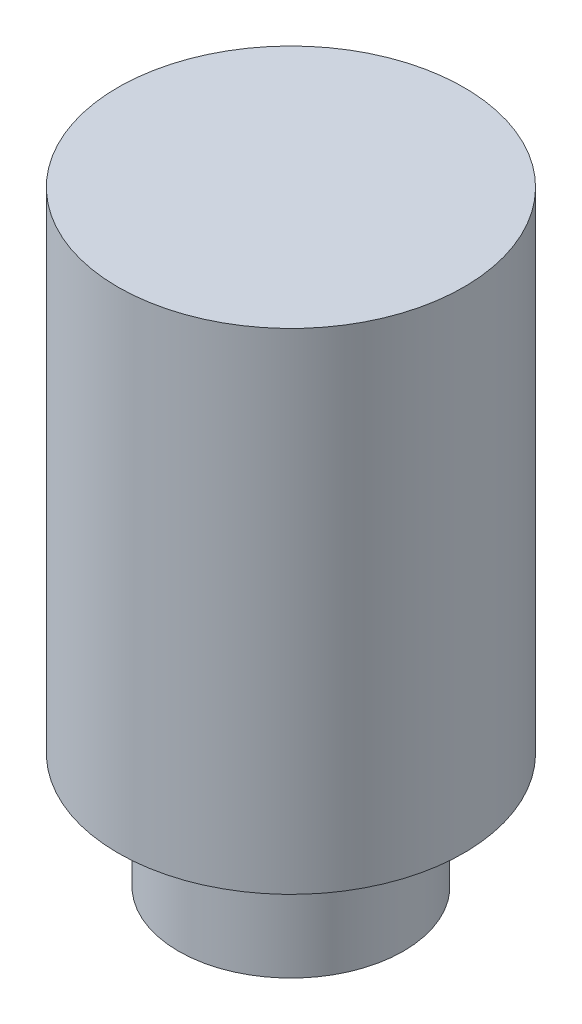
ISO-10303-21;
HEADER;
FILE_DESCRIPTION(('STEP AP214'),'2;1');
FILE_NAME('part.step','',(''),(''),'','','');
FILE_SCHEMA(('AUTOMOTIVE_DESIGN { 1 0 10303 214 1 1 1 1 }'));
ENDSEC;
DATA;
#1=APPLICATION_CONTEXT('core data for automotive mechanical design processes');
#2=APPLICATION_PROTOCOL_DEFINITION('international standard','automotive_design',2000,#1);
#3=PRODUCT_CONTEXT('',#1,'mechanical');
#4=PRODUCT('Part','Part','',(#3));
#5=PRODUCT_RELATED_PRODUCT_CATEGORY('part','',(#4));
#6=PRODUCT_DEFINITION_FORMATION('','',#4);
#7=PRODUCT_DEFINITION_CONTEXT('part definition',#1,'design');
#8=PRODUCT_DEFINITION('design','',#6,#7);
#9=PRODUCT_DEFINITION_SHAPE('','',#8);
#10=(LENGTH_UNIT() NAMED_UNIT(*) SI_UNIT(.MILLI.,.METRE.));
#11=(NAMED_UNIT(*) PLANE_ANGLE_UNIT() SI_UNIT($,.RADIAN.));
#12=(NAMED_UNIT(*) SI_UNIT($,.STERADIAN.) SOLID_ANGLE_UNIT());
#13=UNCERTAINTY_MEASURE_WITH_UNIT(LENGTH_MEASURE(1.E-05),#10,'distance_accuracy_value','');
#14=(GEOMETRIC_REPRESENTATION_CONTEXT(3) GLOBAL_UNCERTAINTY_ASSIGNED_CONTEXT((#13)) GLOBAL_UNIT_ASSIGNED_CONTEXT((#10,
#11,#12)) REPRESENTATION_CONTEXT('',''));
#15=CARTESIAN_POINT('',(0.,0.,0.));
#16=DIRECTION('',(0.,0.,1.));
#17=DIRECTION('',(1.,0.,0.));
#18=AXIS2_PLACEMENT_3D('',#15,#16,#17);
#19=CARTESIAN_POINT('',(0.,2.,0.));
#20=DIRECTION('',(0.,-1.,0.));
#21=DIRECTION('',(0.,0.,-1.));
#22=AXIS2_PLACEMENT_3D('',#19,#20,#21);
#23=CYLINDRICAL_SURFACE('',#22,1.95);
#24=CARTESIAN_POINT('',(0.,2.,0.));
#25=DIRECTION('',(0.,1.,0.));
#26=DIRECTION('',(0.,0.,1.));
#27=AXIS2_PLACEMENT_3D('',#24,#25,#26);
#28=CIRCLE('',#27,1.95);
#29=CARTESIAN_POINT('',(0.,2.,1.95));
#30=VERTEX_POINT('',#29);
#31=EDGE_CURVE('E10',#30,#30,#28,.T.);
#32=ORIENTED_EDGE('',*,*,#31,.F.);
#33=EDGE_LOOP('',(#32));
#34=FACE_BOUND('',#33,.T.);
#35=CARTESIAN_POINT('',(0.,0.,0.));
#36=DIRECTION('',(0.,1.,0.));
#37=DIRECTION('',(0.,0.,1.));
#38=AXIS2_PLACEMENT_3D('',#35,#36,#37);
#39=CIRCLE('',#38,1.95);
#40=CARTESIAN_POINT('',(0.,0.,1.95));
#41=VERTEX_POINT('',#40);
#42=EDGE_CURVE('E36',#41,#41,#39,.T.);
#43=ORIENTED_EDGE('',*,*,#42,.T.);
#44=EDGE_LOOP('',(#43));
#45=FACE_BOUND('',#44,.T.);
#46=ADVANCED_FACE('F33',(#34,#45),#23,.T.);
#47=CARTESIAN_POINT('',(0.,0.,0.));
#48=DIRECTION('',(0.,1.,0.));
#49=DIRECTION('',(0.,0.,1.));
#50=AXIS2_PLACEMENT_3D('',#47,#48,#49);
#51=PLANE('',#50);
#52=ORIENTED_EDGE('',*,*,#42,.F.);
#53=EDGE_LOOP('',(#52));
#54=FACE_BOUND('',#53,.T.);
#55=ADVANCED_FACE('F56',(#54),#51,.F.);
#56=CARTESIAN_POINT('',(0.,10.5,0.));
#57=DIRECTION('',(0.,-1.,0.));
#58=DIRECTION('',(0.,0.,-1.));
#59=AXIS2_PLACEMENT_3D('',#56,#57,#58);
#60=CYLINDRICAL_SURFACE('',#59,3.);
#61=CARTESIAN_POINT('',(0.,10.5,0.));
#62=DIRECTION('',(0.,1.,0.));
#63=DIRECTION('',(0.,0.,1.));
#64=AXIS2_PLACEMENT_3D('',#61,#62,#63);
#65=CIRCLE('',#64,3.);
#66=CARTESIAN_POINT('',(0.,10.5,3.));
#67=VERTEX_POINT('',#66);
#68=EDGE_CURVE('E43',#67,#67,#65,.T.);
#69=ORIENTED_EDGE('',*,*,#68,.F.);
#70=EDGE_LOOP('',(#69));
#71=FACE_BOUND('',#70,.T.);
#72=CARTESIAN_POINT('',(0.,2.,0.));
#73=DIRECTION('',(0.,1.,0.));
#74=DIRECTION('',(0.,0.,1.));
#75=AXIS2_PLACEMENT_3D('',#72,#73,#74);
#76=CIRCLE('',#75,3.);
#77=CARTESIAN_POINT('',(0.,2.,3.));
#78=VERTEX_POINT('',#77);
#79=EDGE_CURVE('E45',#78,#78,#76,.T.);
#80=ORIENTED_EDGE('',*,*,#79,.T.);
#81=EDGE_LOOP('',(#80));
#82=FACE_BOUND('',#81,.T.);
#83=ADVANCED_FACE('F53',(#71,#82),#60,.T.);
#84=CARTESIAN_POINT('',(0.,10.5,0.));
#85=DIRECTION('',(0.,1.,0.));
#86=DIRECTION('',(0.,0.,1.));
#87=AXIS2_PLACEMENT_3D('',#84,#85,#86);
#88=PLANE('',#87);
#89=ORIENTED_EDGE('',*,*,#68,.T.);
#90=EDGE_LOOP('',(#89));
#91=FACE_BOUND('',#90,.T.);
#92=ADVANCED_FACE('F51',(#91),#88,.T.);
#93=CARTESIAN_POINT('',(0.,2.,0.));
#94=DIRECTION('',(0.,1.,0.));
#95=DIRECTION('',(0.,0.,1.));
#96=AXIS2_PLACEMENT_3D('',#93,#94,#95);
#97=PLANE('',#96);
#98=ORIENTED_EDGE('',*,*,#31,.T.);
#99=EDGE_LOOP('',(#98));
#100=FACE_BOUND('',#99,.T.);
#101=ORIENTED_EDGE('',*,*,#79,.F.);
#102=EDGE_LOOP('',(#101));
#103=FACE_BOUND('',#102,.T.);
#104=ADVANCED_FACE('F60',(#100,#103),#97,.F.);
#105=CLOSED_SHELL('',(#46,#55,#83,#92,#104));
#106=MANIFOLD_SOLID_BREP('B2',#105);
#107=ADVANCED_BREP_SHAPE_REPRESENTATION('',(#18,#106),#14);
#108=SHAPE_DEFINITION_REPRESENTATION(#9,#107);
ENDSEC;
END-ISO-10303-21;
